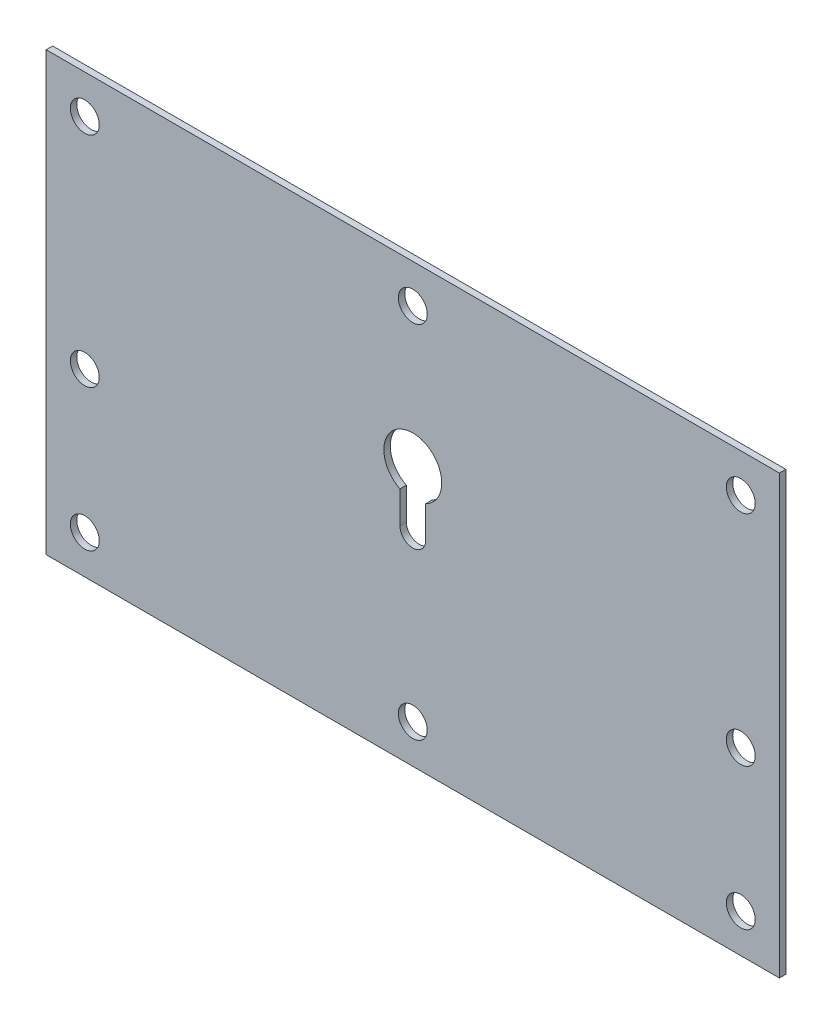
ISO-10303-21;
HEADER;
FILE_DESCRIPTION(('STEP AP214'),'2;1');
FILE_NAME('part.step','',(''),(''),'','','');
FILE_SCHEMA(('AUTOMOTIVE_DESIGN { 1 0 10303 214 1 1 1 1 }'));
ENDSEC;
DATA;
#1=APPLICATION_CONTEXT('core data for automotive mechanical design processes');
#2=APPLICATION_PROTOCOL_DEFINITION('international standard','automotive_design',2000,#1);
#3=PRODUCT_CONTEXT('',#1,'mechanical');
#4=PRODUCT('Part','Part','',(#3));
#5=PRODUCT_RELATED_PRODUCT_CATEGORY('part','',(#4));
#6=PRODUCT_DEFINITION_FORMATION('','',#4);
#7=PRODUCT_DEFINITION_CONTEXT('part definition',#1,'design');
#8=PRODUCT_DEFINITION('design','',#6,#7);
#9=PRODUCT_DEFINITION_SHAPE('','',#8);
#10=(LENGTH_UNIT() NAMED_UNIT(*) SI_UNIT(.MILLI.,.METRE.));
#11=(NAMED_UNIT(*) PLANE_ANGLE_UNIT() SI_UNIT($,.RADIAN.));
#12=(NAMED_UNIT(*) SI_UNIT($,.STERADIAN.) SOLID_ANGLE_UNIT());
#13=UNCERTAINTY_MEASURE_WITH_UNIT(LENGTH_MEASURE(1.E-05),#10,'distance_accuracy_value','');
#14=(GEOMETRIC_REPRESENTATION_CONTEXT(3) GLOBAL_UNCERTAINTY_ASSIGNED_CONTEXT((#13)) GLOBAL_UNIT_ASSIGNED_CONTEXT((#10,
#11,#12)) REPRESENTATION_CONTEXT('',''));
#15=CARTESIAN_POINT('',(0.,0.,0.));
#16=DIRECTION('',(0.,0.,1.));
#17=DIRECTION('',(1.,0.,0.));
#18=AXIS2_PLACEMENT_3D('',#15,#16,#17);
#19=CARTESIAN_POINT('',(0.,0.,1.));
#20=DIRECTION('',(1.,0.,0.));
#21=DIRECTION('',(0.,0.,-1.));
#22=AXIS2_PLACEMENT_3D('',#19,#20,#21);
#23=PLANE('',#22);
#24=DIRECTION('',(0.,-1.,0.));
#25=VECTOR('',#24,1.);
#26=CARTESIAN_POINT('',(0.,0.,0.));
#27=LINE('',#26,#25);
#28=CARTESIAN_POINT('',(0.,68.,0.));
#29=VERTEX_POINT('',#28);
#30=CARTESIAN_POINT('',(0.,0.,0.));
#31=VERTEX_POINT('',#30);
#32=EDGE_CURVE('E175',#29,#31,#27,.T.);
#33=ORIENTED_EDGE('',*,*,#32,.T.);
#34=DIRECTION('',(0.,0.,-1.));
#35=VECTOR('',#34,1.);
#36=CARTESIAN_POINT('',(0.,0.,1.));
#37=LINE('',#36,#35);
#38=CARTESIAN_POINT('',(0.,0.,1.));
#39=VERTEX_POINT('',#38);
#40=EDGE_CURVE('E11',#39,#31,#37,.T.);
#41=ORIENTED_EDGE('',*,*,#40,.F.);
#42=DIRECTION('',(0.,-1.,0.));
#43=VECTOR('',#42,1.);
#44=CARTESIAN_POINT('',(0.,0.,1.));
#45=LINE('',#44,#43);
#46=CARTESIAN_POINT('',(0.,68.,1.));
#47=VERTEX_POINT('',#46);
#48=EDGE_CURVE('E178',#47,#39,#45,.T.);
#49=ORIENTED_EDGE('',*,*,#48,.F.);
#50=DIRECTION('',(0.,0.,-1.));
#51=VECTOR('',#50,1.);
#52=CARTESIAN_POINT('',(0.,68.,1.));
#53=LINE('',#52,#51);
#54=EDGE_CURVE('E188',#47,#29,#53,.T.);
#55=ORIENTED_EDGE('',*,*,#54,.T.);
#56=EDGE_LOOP('',(#33,#41,#49,#55));
#57=FACE_BOUND('',#56,.T.);
#58=ADVANCED_FACE('F35',(#57),#23,.F.);
#59=CARTESIAN_POINT('',(0.,0.,1.));
#60=DIRECTION('',(0.,1.,0.));
#61=DIRECTION('',(0.,0.,1.));
#62=AXIS2_PLACEMENT_3D('',#59,#60,#61);
#63=PLANE('',#62);
#64=DIRECTION('',(1.,0.,0.));
#65=VECTOR('',#64,1.);
#66=CARTESIAN_POINT('',(0.,0.,0.));
#67=LINE('',#66,#65);
#68=CARTESIAN_POINT('',(114.,0.,0.));
#69=VERTEX_POINT('',#68);
#70=EDGE_CURVE('E191',#31,#69,#67,.T.);
#71=ORIENTED_EDGE('',*,*,#70,.T.);
#72=DIRECTION('',(0.,0.,-1.));
#73=VECTOR('',#72,1.);
#74=CARTESIAN_POINT('',(114.,0.,1.));
#75=LINE('',#74,#73);
#76=CARTESIAN_POINT('',(114.,0.,1.));
#77=VERTEX_POINT('',#76);
#78=EDGE_CURVE('E42',#77,#69,#75,.T.);
#79=ORIENTED_EDGE('',*,*,#78,.F.);
#80=DIRECTION('',(1.,0.,0.));
#81=VECTOR('',#80,1.);
#82=CARTESIAN_POINT('',(0.,0.,1.));
#83=LINE('',#82,#81);
#84=EDGE_CURVE('E181',#39,#77,#83,.T.);
#85=ORIENTED_EDGE('',*,*,#84,.F.);
#86=ORIENTED_EDGE('',*,*,#40,.T.);
#87=EDGE_LOOP('',(#71,#79,#85,#86));
#88=FACE_BOUND('',#87,.T.);
#89=ADVANCED_FACE('F220',(#88),#63,.F.);
#90=CARTESIAN_POINT('',(114.,0.,1.));
#91=DIRECTION('',(-1.,0.,0.));
#92=DIRECTION('',(0.,0.,1.));
#93=AXIS2_PLACEMENT_3D('',#90,#91,#92);
#94=PLANE('',#93);
#95=DIRECTION('',(0.,1.,0.));
#96=VECTOR('',#95,1.);
#97=CARTESIAN_POINT('',(114.,0.,0.));
#98=LINE('',#97,#96);
#99=CARTESIAN_POINT('',(114.,68.,0.));
#100=VERTEX_POINT('',#99);
#101=EDGE_CURVE('E193',#69,#100,#98,.T.);
#102=ORIENTED_EDGE('',*,*,#101,.T.);
#103=DIRECTION('',(0.,0.,-1.));
#104=VECTOR('',#103,1.);
#105=CARTESIAN_POINT('',(114.,68.,1.));
#106=LINE('',#105,#104);
#107=CARTESIAN_POINT('',(114.,68.,1.));
#108=VERTEX_POINT('',#107);
#109=EDGE_CURVE('E198',#108,#100,#106,.T.);
#110=ORIENTED_EDGE('',*,*,#109,.F.);
#111=DIRECTION('',(0.,1.,0.));
#112=VECTOR('',#111,1.);
#113=CARTESIAN_POINT('',(114.,0.,1.));
#114=LINE('',#113,#112);
#115=EDGE_CURVE('E184',#77,#108,#114,.T.);
#116=ORIENTED_EDGE('',*,*,#115,.F.);
#117=ORIENTED_EDGE('',*,*,#78,.T.);
#118=EDGE_LOOP('',(#102,#110,#116,#117));
#119=FACE_BOUND('',#118,.T.);
#120=ADVANCED_FACE('F205',(#119),#94,.F.);
#121=CARTESIAN_POINT('',(0.,68.,1.));
#122=DIRECTION('',(0.,-1.,0.));
#123=DIRECTION('',(0.,0.,-1.));
#124=AXIS2_PLACEMENT_3D('',#121,#122,#123);
#125=PLANE('',#124);
#126=DIRECTION('',(-1.,0.,0.));
#127=VECTOR('',#126,1.);
#128=CARTESIAN_POINT('',(0.,68.,0.));
#129=LINE('',#128,#127);
#130=EDGE_CURVE('E182',#100,#29,#129,.T.);
#131=ORIENTED_EDGE('',*,*,#130,.T.);
#132=ORIENTED_EDGE('',*,*,#54,.F.);
#133=DIRECTION('',(-1.,0.,0.));
#134=VECTOR('',#133,1.);
#135=CARTESIAN_POINT('',(0.,68.,1.));
#136=LINE('',#135,#134);
#137=EDGE_CURVE('E186',#108,#47,#136,.T.);
#138=ORIENTED_EDGE('',*,*,#137,.F.);
#139=ORIENTED_EDGE('',*,*,#109,.T.);
#140=EDGE_LOOP('',(#131,#132,#138,#139));
#141=FACE_BOUND('',#140,.T.);
#142=ADVANCED_FACE('F213',(#141),#125,.F.);
#143=CARTESIAN_POINT('',(0.,0.,1.));
#144=DIRECTION('',(0.,0.,-1.));
#145=DIRECTION('',(-1.,0.,0.));
#146=AXIS2_PLACEMENT_3D('',#143,#144,#145);
#147=PLANE('',#146);
#148=CARTESIAN_POINT('',(108.,62.,1.));
#149=DIRECTION('',(0.,0.,1.));
#150=DIRECTION('',(1.,0.,0.));
#151=AXIS2_PLACEMENT_3D('',#148,#149,#150);
#152=CIRCLE('',#151,2.24999999999999);
#153=CARTESIAN_POINT('',(110.25,62.,1.));
#154=VERTEX_POINT('',#153);
#155=EDGE_CURVE('E134',#154,#154,#152,.T.);
#156=ORIENTED_EDGE('',*,*,#155,.F.);
#157=EDGE_LOOP('',(#156));
#158=FACE_BOUND('',#157,.T.);
#159=CARTESIAN_POINT('',(108.,28.,1.));
#160=DIRECTION('',(0.,0.,1.));
#161=DIRECTION('',(1.,0.,0.));
#162=AXIS2_PLACEMENT_3D('',#159,#160,#161);
#163=CIRCLE('',#162,2.25);
#164=CARTESIAN_POINT('',(110.25,28.,1.));
#165=VERTEX_POINT('',#164);
#166=EDGE_CURVE('E141',#165,#165,#163,.T.);
#167=ORIENTED_EDGE('',*,*,#166,.F.);
#168=EDGE_LOOP('',(#167));
#169=FACE_BOUND('',#168,.T.);
#170=CARTESIAN_POINT('',(108.,6.,1.));
#171=DIRECTION('',(0.,0.,1.));
#172=DIRECTION('',(1.,0.,0.));
#173=AXIS2_PLACEMENT_3D('',#170,#171,#172);
#174=CIRCLE('',#173,2.25);
#175=CARTESIAN_POINT('',(110.25,6.,1.));
#176=VERTEX_POINT('',#175);
#177=EDGE_CURVE('E147',#176,#176,#174,.T.);
#178=ORIENTED_EDGE('',*,*,#177,.F.);
#179=EDGE_LOOP('',(#178));
#180=FACE_BOUND('',#179,.T.);
#181=DIRECTION('',(0.,-1.,0.));
#182=VECTOR('',#181,1.);
#183=CARTESIAN_POINT('',(55.,36.3688711258507,1.));
#184=LINE('',#183,#182);
#185=CARTESIAN_POINT('',(55.,36.3688711258507,1.));
#186=VERTEX_POINT('',#185);
#187=CARTESIAN_POINT('',(55.,31.4,1.));
#188=VERTEX_POINT('',#187);
#189=EDGE_CURVE('E118',#186,#188,#184,.T.);
#190=ORIENTED_EDGE('',*,*,#189,.F.);
#191=CARTESIAN_POINT('',(57.,40.4,1.));
#192=DIRECTION('',(0.,0.,1.));
#193=DIRECTION('',(1.,0.,0.));
#194=AXIS2_PLACEMENT_3D('',#191,#192,#193);
#195=CIRCLE('',#194,4.5);
#196=CARTESIAN_POINT('',(59.,36.3688711258507,1.));
#197=VERTEX_POINT('',#196);
#198=EDGE_CURVE('E49',#197,#186,#195,.T.);
#199=ORIENTED_EDGE('',*,*,#198,.F.);
#200=DIRECTION('',(0.,1.,0.));
#201=VECTOR('',#200,1.);
#202=CARTESIAN_POINT('',(59.,36.3688711258507,1.));
#203=LINE('',#202,#201);
#204=CARTESIAN_POINT('',(59.,31.4,1.));
#205=VERTEX_POINT('',#204);
#206=EDGE_CURVE('E111',#205,#197,#203,.T.);
#207=ORIENTED_EDGE('',*,*,#206,.F.);
#208=CARTESIAN_POINT('',(57.,31.4,1.));
#209=DIRECTION('',(0.,0.,1.));
#210=DIRECTION('',(1.,0.,0.));
#211=AXIS2_PLACEMENT_3D('',#208,#209,#210);
#212=CIRCLE('',#211,2.);
#213=EDGE_CURVE('E125',#188,#205,#212,.T.);
#214=ORIENTED_EDGE('',*,*,#213,.F.);
#215=EDGE_LOOP('',(#190,#199,#207,#214));
#216=FACE_BOUND('',#215,.T.);
#217=CARTESIAN_POINT('',(57.,62.,1.));
#218=DIRECTION('',(0.,0.,1.));
#219=DIRECTION('',(1.,0.,0.));
#220=AXIS2_PLACEMENT_3D('',#217,#218,#219);
#221=CIRCLE('',#220,2.25);
#222=CARTESIAN_POINT('',(59.25,62.,1.));
#223=VERTEX_POINT('',#222);
#224=EDGE_CURVE('E167',#223,#223,#221,.T.);
#225=ORIENTED_EDGE('',*,*,#224,.F.);
#226=EDGE_LOOP('',(#225));
#227=FACE_BOUND('',#226,.T.);
#228=CARTESIAN_POINT('',(57.,6.,1.));
#229=DIRECTION('',(0.,0.,1.));
#230=DIRECTION('',(1.,0.,0.));
#231=AXIS2_PLACEMENT_3D('',#228,#229,#230);
#232=CIRCLE('',#231,2.25);
#233=CARTESIAN_POINT('',(59.25,6.,1.));
#234=VERTEX_POINT('',#233);
#235=EDGE_CURVE('E161',#234,#234,#232,.T.);
#236=ORIENTED_EDGE('',*,*,#235,.F.);
#237=EDGE_LOOP('',(#236));
#238=FACE_BOUND('',#237,.T.);
#239=CARTESIAN_POINT('',(6.00000000000001,62.,1.));
#240=DIRECTION('',(0.,0.,1.));
#241=DIRECTION('',(1.,0.,0.));
#242=AXIS2_PLACEMENT_3D('',#239,#240,#241);
#243=CIRCLE('',#242,2.25);
#244=CARTESIAN_POINT('',(8.25,62.,1.));
#245=VERTEX_POINT('',#244);
#246=EDGE_CURVE('E155',#245,#245,#243,.T.);
#247=ORIENTED_EDGE('',*,*,#246,.F.);
#248=EDGE_LOOP('',(#247));
#249=FACE_BOUND('',#248,.T.);
#250=CARTESIAN_POINT('',(6.00000000000001,6.,1.));
#251=DIRECTION('',(0.,0.,1.));
#252=DIRECTION('',(1.,0.,0.));
#253=AXIS2_PLACEMENT_3D('',#250,#251,#252);
#254=CIRCLE('',#253,2.25);
#255=CARTESIAN_POINT('',(8.25000000000001,6.,1.));
#256=VERTEX_POINT('',#255);
#257=EDGE_CURVE('E148',#256,#256,#254,.T.);
#258=ORIENTED_EDGE('',*,*,#257,.F.);
#259=EDGE_LOOP('',(#258));
#260=FACE_BOUND('',#259,.T.);
#261=CARTESIAN_POINT('',(6.,28.,1.));
#262=DIRECTION('',(0.,0.,1.));
#263=DIRECTION('',(1.,0.,0.));
#264=AXIS2_PLACEMENT_3D('',#261,#262,#263);
#265=CIRCLE('',#264,2.25);
#266=CARTESIAN_POINT('',(8.25000000000001,28.,1.));
#267=VERTEX_POINT('',#266);
#268=EDGE_CURVE('E172',#267,#267,#265,.T.);
#269=ORIENTED_EDGE('',*,*,#268,.F.);
#270=EDGE_LOOP('',(#269));
#271=FACE_BOUND('',#270,.T.);
#272=ORIENTED_EDGE('',*,*,#48,.T.);
#273=ORIENTED_EDGE('',*,*,#84,.T.);
#274=ORIENTED_EDGE('',*,*,#115,.T.);
#275=ORIENTED_EDGE('',*,*,#137,.T.);
#276=EDGE_LOOP('',(#272,#273,#274,#275));
#277=FACE_BOUND('',#276,.T.);
#278=ADVANCED_FACE('F219',(#158,#169,#180,#216,#227,#238,#249,#260,#271,#277),#147,.F.);
#279=CARTESIAN_POINT('',(0.,0.,0.));
#280=DIRECTION('',(0.,0.,-1.));
#281=DIRECTION('',(-1.,0.,0.));
#282=AXIS2_PLACEMENT_3D('',#279,#280,#281);
#283=PLANE('',#282);
#284=CARTESIAN_POINT('',(108.,62.,0.));
#285=DIRECTION('',(0.,0.,-1.));
#286=DIRECTION('',(-1.,0.,0.));
#287=AXIS2_PLACEMENT_3D('',#284,#285,#286);
#288=CIRCLE('',#287,2.24999999999999);
#289=CARTESIAN_POINT('',(105.75,62.,0.));
#290=VERTEX_POINT('',#289);
#291=EDGE_CURVE('E138',#290,#290,#288,.F.);
#292=ORIENTED_EDGE('',*,*,#291,.T.);
#293=EDGE_LOOP('',(#292));
#294=FACE_BOUND('',#293,.T.);
#295=CARTESIAN_POINT('',(108.,28.,0.));
#296=DIRECTION('',(0.,0.,-1.));
#297=DIRECTION('',(-1.,0.,0.));
#298=AXIS2_PLACEMENT_3D('',#295,#296,#297);
#299=CIRCLE('',#298,2.25);
#300=CARTESIAN_POINT('',(105.75,28.,0.));
#301=VERTEX_POINT('',#300);
#302=EDGE_CURVE('E144',#301,#301,#299,.F.);
#303=ORIENTED_EDGE('',*,*,#302,.T.);
#304=EDGE_LOOP('',(#303));
#305=FACE_BOUND('',#304,.T.);
#306=CARTESIAN_POINT('',(108.,6.,0.));
#307=DIRECTION('',(0.,0.,-1.));
#308=DIRECTION('',(-1.,0.,0.));
#309=AXIS2_PLACEMENT_3D('',#306,#307,#308);
#310=CIRCLE('',#309,2.25);
#311=CARTESIAN_POINT('',(105.75,6.,0.));
#312=VERTEX_POINT('',#311);
#313=EDGE_CURVE('E105',#312,#312,#310,.F.);
#314=ORIENTED_EDGE('',*,*,#313,.T.);
#315=EDGE_LOOP('',(#314));
#316=FACE_BOUND('',#315,.T.);
#317=CARTESIAN_POINT('',(57.,40.4,0.));
#318=DIRECTION('',(0.,0.,-1.));
#319=DIRECTION('',(-1.,0.,0.));
#320=AXIS2_PLACEMENT_3D('',#317,#318,#319);
#321=CIRCLE('',#320,4.5);
#322=CARTESIAN_POINT('',(59.,36.3688711258507,0.));
#323=VERTEX_POINT('',#322);
#324=CARTESIAN_POINT('',(55.,36.3688711258507,0.));
#325=VERTEX_POINT('',#324);
#326=EDGE_CURVE('E109',#323,#325,#321,.F.);
#327=ORIENTED_EDGE('',*,*,#326,.T.);
#328=DIRECTION('',(0.,-1.,0.));
#329=VECTOR('',#328,1.);
#330=CARTESIAN_POINT('',(55.,36.3688711258507,0.));
#331=LINE('',#330,#329);
#332=CARTESIAN_POINT('',(55.,31.4,0.));
#333=VERTEX_POINT('',#332);
#334=EDGE_CURVE('E98',#325,#333,#331,.T.);
#335=ORIENTED_EDGE('',*,*,#334,.T.);
#336=CARTESIAN_POINT('',(57.,31.4,0.));
#337=DIRECTION('',(0.,0.,-1.));
#338=DIRECTION('',(-1.,0.,0.));
#339=AXIS2_PLACEMENT_3D('',#336,#337,#338);
#340=CIRCLE('',#339,2.);
#341=CARTESIAN_POINT('',(59.,31.4,0.));
#342=VERTEX_POINT('',#341);
#343=EDGE_CURVE('E120',#333,#342,#340,.F.);
#344=ORIENTED_EDGE('',*,*,#343,.T.);
#345=DIRECTION('',(0.,1.,0.));
#346=VECTOR('',#345,1.);
#347=CARTESIAN_POINT('',(59.,36.3688711258507,0.));
#348=LINE('',#347,#346);
#349=EDGE_CURVE('E116',#342,#323,#348,.T.);
#350=ORIENTED_EDGE('',*,*,#349,.T.);
#351=EDGE_LOOP('',(#327,#335,#344,#350));
#352=FACE_BOUND('',#351,.T.);
#353=CARTESIAN_POINT('',(57.,62.,0.));
#354=DIRECTION('',(0.,0.,-1.));
#355=DIRECTION('',(-1.,0.,0.));
#356=AXIS2_PLACEMENT_3D('',#353,#354,#355);
#357=CIRCLE('',#356,2.25);
#358=CARTESIAN_POINT('',(54.75,62.,0.));
#359=VERTEX_POINT('',#358);
#360=EDGE_CURVE('E137',#359,#359,#357,.F.);
#361=ORIENTED_EDGE('',*,*,#360,.T.);
#362=EDGE_LOOP('',(#361));
#363=FACE_BOUND('',#362,.T.);
#364=CARTESIAN_POINT('',(57.,6.,0.));
#365=DIRECTION('',(0.,0.,-1.));
#366=DIRECTION('',(-1.,0.,0.));
#367=AXIS2_PLACEMENT_3D('',#364,#365,#366);
#368=CIRCLE('',#367,2.25);
#369=CARTESIAN_POINT('',(54.75,6.,0.));
#370=VERTEX_POINT('',#369);
#371=EDGE_CURVE('E164',#370,#370,#368,.F.);
#372=ORIENTED_EDGE('',*,*,#371,.T.);
#373=EDGE_LOOP('',(#372));
#374=FACE_BOUND('',#373,.T.);
#375=CARTESIAN_POINT('',(6.00000000000001,62.,0.));
#376=DIRECTION('',(0.,0.,-1.));
#377=DIRECTION('',(-1.,0.,0.));
#378=AXIS2_PLACEMENT_3D('',#375,#376,#377);
#379=CIRCLE('',#378,2.25);
#380=CARTESIAN_POINT('',(3.75000000000001,62.,0.));
#381=VERTEX_POINT('',#380);
#382=EDGE_CURVE('E158',#381,#381,#379,.F.);
#383=ORIENTED_EDGE('',*,*,#382,.T.);
#384=EDGE_LOOP('',(#383));
#385=FACE_BOUND('',#384,.T.);
#386=CARTESIAN_POINT('',(6.00000000000001,6.,0.));
#387=DIRECTION('',(0.,0.,-1.));
#388=DIRECTION('',(-1.,0.,0.));
#389=AXIS2_PLACEMENT_3D('',#386,#387,#388);
#390=CIRCLE('',#389,2.25);
#391=CARTESIAN_POINT('',(3.75000000000001,6.,0.));
#392=VERTEX_POINT('',#391);
#393=EDGE_CURVE('E152',#392,#392,#390,.F.);
#394=ORIENTED_EDGE('',*,*,#393,.T.);
#395=EDGE_LOOP('',(#394));
#396=FACE_BOUND('',#395,.T.);
#397=CARTESIAN_POINT('',(6.,28.,0.));
#398=DIRECTION('',(0.,0.,-1.));
#399=DIRECTION('',(-1.,0.,0.));
#400=AXIS2_PLACEMENT_3D('',#397,#398,#399);
#401=CIRCLE('',#400,2.25);
#402=CARTESIAN_POINT('',(3.75,28.,0.));
#403=VERTEX_POINT('',#402);
#404=EDGE_CURVE('E151',#403,#403,#401,.F.);
#405=ORIENTED_EDGE('',*,*,#404,.T.);
#406=EDGE_LOOP('',(#405));
#407=FACE_BOUND('',#406,.T.);
#408=ORIENTED_EDGE('',*,*,#32,.F.);
#409=ORIENTED_EDGE('',*,*,#130,.F.);
#410=ORIENTED_EDGE('',*,*,#101,.F.);
#411=ORIENTED_EDGE('',*,*,#70,.F.);
#412=EDGE_LOOP('',(#408,#409,#410,#411));
#413=FACE_BOUND('',#412,.T.);
#414=ADVANCED_FACE('F114',(#294,#305,#316,#352,#363,#374,#385,#396,#407,#413),#283,.T.);
#415=CARTESIAN_POINT('',(6.,28.,-0.000999999999999916));
#416=DIRECTION('',(0.,0.,1.));
#417=DIRECTION('',(1.,0.,0.));
#418=AXIS2_PLACEMENT_3D('',#415,#416,#417);
#419=CYLINDRICAL_SURFACE('',#418,2.25);
#420=ORIENTED_EDGE('',*,*,#404,.F.);
#421=EDGE_LOOP('',(#420));
#422=FACE_BOUND('',#421,.T.);
#423=ORIENTED_EDGE('',*,*,#268,.T.);
#424=EDGE_LOOP('',(#423));
#425=FACE_BOUND('',#424,.T.);
#426=ADVANCED_FACE('F232',(#422,#425),#419,.F.);
#427=CARTESIAN_POINT('',(6.00000000000001,6.,-0.000999999999999916));
#428=DIRECTION('',(0.,0.,1.));
#429=DIRECTION('',(1.,0.,0.));
#430=AXIS2_PLACEMENT_3D('',#427,#428,#429);
#431=CYLINDRICAL_SURFACE('',#430,2.25);
#432=ORIENTED_EDGE('',*,*,#393,.F.);
#433=EDGE_LOOP('',(#432));
#434=FACE_BOUND('',#433,.T.);
#435=ORIENTED_EDGE('',*,*,#257,.T.);
#436=EDGE_LOOP('',(#435));
#437=FACE_BOUND('',#436,.T.);
#438=ADVANCED_FACE('F239',(#434,#437),#431,.F.);
#439=CARTESIAN_POINT('',(6.00000000000001,62.,-0.000999999999999916));
#440=DIRECTION('',(0.,0.,1.));
#441=DIRECTION('',(1.,0.,0.));
#442=AXIS2_PLACEMENT_3D('',#439,#440,#441);
#443=CYLINDRICAL_SURFACE('',#442,2.25);
#444=ORIENTED_EDGE('',*,*,#382,.F.);
#445=EDGE_LOOP('',(#444));
#446=FACE_BOUND('',#445,.T.);
#447=ORIENTED_EDGE('',*,*,#246,.T.);
#448=EDGE_LOOP('',(#447));
#449=FACE_BOUND('',#448,.T.);
#450=ADVANCED_FACE('F248',(#446,#449),#443,.F.);
#451=CARTESIAN_POINT('',(57.,6.,-0.000999999999999916));
#452=DIRECTION('',(0.,0.,1.));
#453=DIRECTION('',(1.,0.,0.));
#454=AXIS2_PLACEMENT_3D('',#451,#452,#453);
#455=CYLINDRICAL_SURFACE('',#454,2.25);
#456=ORIENTED_EDGE('',*,*,#371,.F.);
#457=EDGE_LOOP('',(#456));
#458=FACE_BOUND('',#457,.T.);
#459=ORIENTED_EDGE('',*,*,#235,.T.);
#460=EDGE_LOOP('',(#459));
#461=FACE_BOUND('',#460,.T.);
#462=ADVANCED_FACE('F244',(#458,#461),#455,.F.);
#463=CARTESIAN_POINT('',(57.,62.,-0.000999999999999916));
#464=DIRECTION('',(0.,0.,1.));
#465=DIRECTION('',(1.,0.,0.));
#466=AXIS2_PLACEMENT_3D('',#463,#464,#465);
#467=CYLINDRICAL_SURFACE('',#466,2.25);
#468=ORIENTED_EDGE('',*,*,#360,.F.);
#469=EDGE_LOOP('',(#468));
#470=FACE_BOUND('',#469,.T.);
#471=ORIENTED_EDGE('',*,*,#224,.T.);
#472=EDGE_LOOP('',(#471));
#473=FACE_BOUND('',#472,.T.);
#474=ADVANCED_FACE('F241',(#470,#473),#467,.F.);
#475=CARTESIAN_POINT('',(57.,40.4,-0.000999999999999916));
#476=DIRECTION('',(0.,0.,1.));
#477=DIRECTION('',(1.,0.,0.));
#478=AXIS2_PLACEMENT_3D('',#475,#476,#477);
#479=CYLINDRICAL_SURFACE('',#478,4.5);
#480=DIRECTION('',(0.,0.,1.));
#481=VECTOR('',#480,1.);
#482=CARTESIAN_POINT('',(59.,36.3688711258507,-0.000999999999999916));
#483=LINE('',#482,#481);
#484=EDGE_CURVE('E106',#323,#197,#483,.T.);
#485=ORIENTED_EDGE('',*,*,#484,.T.);
#486=ORIENTED_EDGE('',*,*,#198,.T.);
#487=DIRECTION('',(0.,0.,1.));
#488=VECTOR('',#487,1.);
#489=CARTESIAN_POINT('',(55.,36.3688711258507,-0.000999999999999916));
#490=LINE('',#489,#488);
#491=EDGE_CURVE('E100',#325,#186,#490,.T.);
#492=ORIENTED_EDGE('',*,*,#491,.F.);
#493=ORIENTED_EDGE('',*,*,#326,.F.);
#494=EDGE_LOOP('',(#485,#486,#492,#493));
#495=FACE_BOUND('',#494,.T.);
#496=ADVANCED_FACE('F108',(#495),#479,.F.);
#497=CARTESIAN_POINT('',(59.,36.3688711258507,-0.000999999999999916));
#498=DIRECTION('',(1.,0.,0.));
#499=DIRECTION('',(0.,1.,0.));
#500=AXIS2_PLACEMENT_3D('',#497,#498,#499);
#501=PLANE('',#500);
#502=DIRECTION('',(0.,0.,1.));
#503=VECTOR('',#502,1.);
#504=CARTESIAN_POINT('',(59.,31.4,-0.000999999999999916));
#505=LINE('',#504,#503);
#506=EDGE_CURVE('E131',#342,#205,#505,.T.);
#507=ORIENTED_EDGE('',*,*,#506,.T.);
#508=ORIENTED_EDGE('',*,*,#206,.T.);
#509=ORIENTED_EDGE('',*,*,#484,.F.);
#510=ORIENTED_EDGE('',*,*,#349,.F.);
#511=EDGE_LOOP('',(#507,#508,#509,#510));
#512=FACE_BOUND('',#511,.T.);
#513=ADVANCED_FACE('F267',(#512),#501,.F.);
#514=CARTESIAN_POINT('',(57.,31.4,-0.000999999999999916));
#515=DIRECTION('',(0.,0.,1.));
#516=DIRECTION('',(1.,0.,0.));
#517=AXIS2_PLACEMENT_3D('',#514,#515,#516);
#518=CYLINDRICAL_SURFACE('',#517,2.);
#519=DIRECTION('',(0.,0.,1.));
#520=VECTOR('',#519,1.);
#521=CARTESIAN_POINT('',(55.,31.4,-0.000999999999999916));
#522=LINE('',#521,#520);
#523=EDGE_CURVE('E57',#333,#188,#522,.T.);
#524=ORIENTED_EDGE('',*,*,#523,.T.);
#525=ORIENTED_EDGE('',*,*,#213,.T.);
#526=ORIENTED_EDGE('',*,*,#506,.F.);
#527=ORIENTED_EDGE('',*,*,#343,.F.);
#528=EDGE_LOOP('',(#524,#525,#526,#527));
#529=FACE_BOUND('',#528,.T.);
#530=ADVANCED_FACE('F270',(#529),#518,.F.);
#531=CARTESIAN_POINT('',(55.,36.3688711258507,-0.000999999999999916));
#532=DIRECTION('',(-1.,0.,0.));
#533=DIRECTION('',(0.,0.,1.));
#534=AXIS2_PLACEMENT_3D('',#531,#532,#533);
#535=PLANE('',#534);
#536=ORIENTED_EDGE('',*,*,#491,.T.);
#537=ORIENTED_EDGE('',*,*,#189,.T.);
#538=ORIENTED_EDGE('',*,*,#523,.F.);
#539=ORIENTED_EDGE('',*,*,#334,.F.);
#540=EDGE_LOOP('',(#536,#537,#538,#539));
#541=FACE_BOUND('',#540,.T.);
#542=ADVANCED_FACE('F99',(#541),#535,.F.);
#543=CARTESIAN_POINT('',(108.,6.,-0.000999999999999916));
#544=DIRECTION('',(0.,0.,1.));
#545=DIRECTION('',(1.,0.,0.));
#546=AXIS2_PLACEMENT_3D('',#543,#544,#545);
#547=CYLINDRICAL_SURFACE('',#546,2.25);
#548=ORIENTED_EDGE('',*,*,#313,.F.);
#549=EDGE_LOOP('',(#548));
#550=FACE_BOUND('',#549,.T.);
#551=ORIENTED_EDGE('',*,*,#177,.T.);
#552=EDGE_LOOP('',(#551));
#553=FACE_BOUND('',#552,.T.);
#554=ADVANCED_FACE('F260',(#550,#553),#547,.F.);
#555=CARTESIAN_POINT('',(108.,28.,-0.000999999999999916));
#556=DIRECTION('',(0.,0.,1.));
#557=DIRECTION('',(1.,0.,0.));
#558=AXIS2_PLACEMENT_3D('',#555,#556,#557);
#559=CYLINDRICAL_SURFACE('',#558,2.25);
#560=ORIENTED_EDGE('',*,*,#302,.F.);
#561=EDGE_LOOP('',(#560));
#562=FACE_BOUND('',#561,.T.);
#563=ORIENTED_EDGE('',*,*,#166,.T.);
#564=EDGE_LOOP('',(#563));
#565=FACE_BOUND('',#564,.T.);
#566=ADVANCED_FACE('F256',(#562,#565),#559,.F.);
#567=CARTESIAN_POINT('',(108.,62.,-0.000999999999999916));
#568=DIRECTION('',(0.,0.,1.));
#569=DIRECTION('',(1.,0.,0.));
#570=AXIS2_PLACEMENT_3D('',#567,#568,#569);
#571=CYLINDRICAL_SURFACE('',#570,2.24999999999999);
#572=ORIENTED_EDGE('',*,*,#291,.F.);
#573=EDGE_LOOP('',(#572));
#574=FACE_BOUND('',#573,.T.);
#575=ORIENTED_EDGE('',*,*,#155,.T.);
#576=EDGE_LOOP('',(#575));
#577=FACE_BOUND('',#576,.T.);
#578=ADVANCED_FACE('F259',(#574,#577),#571,.F.);
#579=CLOSED_SHELL('',(#58,#89,#120,#142,#278,#414,#426,#438,#450,#462,#474,#496,#513,#530,#542,
#554,#566,#578));
#580=MANIFOLD_SOLID_BREP('B2',#579);
#581=ADVANCED_BREP_SHAPE_REPRESENTATION('',(#18,#580),#14);
#582=SHAPE_DEFINITION_REPRESENTATION(#9,#581);
ENDSEC;
END-ISO-10303-21;
